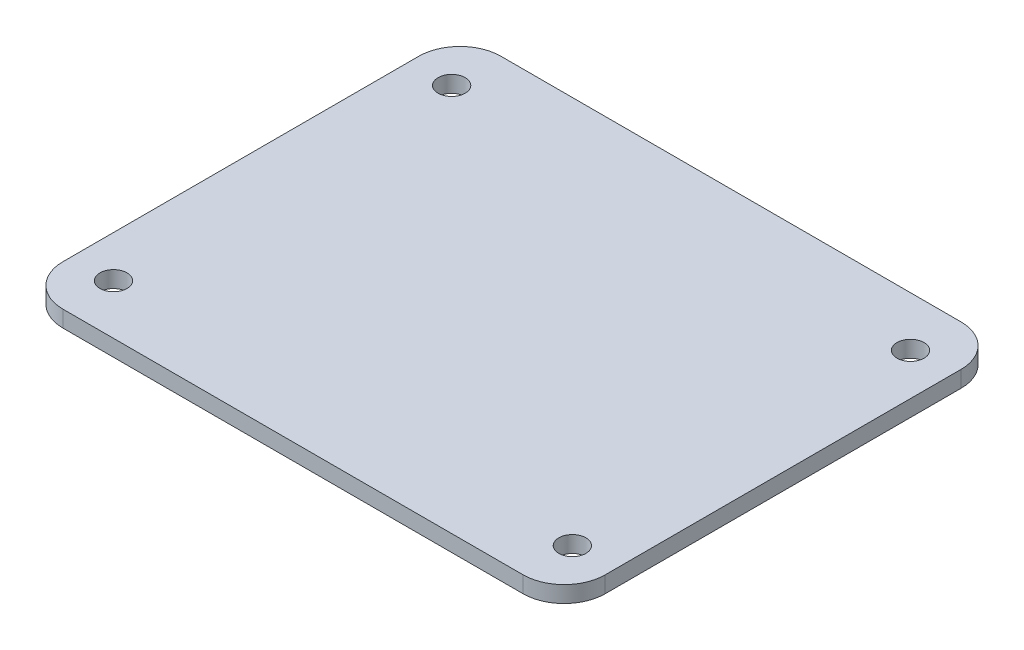
ISO-10303-21;
HEADER;
FILE_DESCRIPTION(('STEP AP214'),'2;1');
FILE_NAME('part.step','',(''),(''),'','','');
FILE_SCHEMA(('AUTOMOTIVE_DESIGN { 1 0 10303 214 1 1 1 1 }'));
ENDSEC;
DATA;
#1=APPLICATION_CONTEXT('core data for automotive mechanical design processes');
#2=APPLICATION_PROTOCOL_DEFINITION('international standard','automotive_design',2000,#1);
#3=PRODUCT_CONTEXT('',#1,'mechanical');
#4=PRODUCT('Part','Part','',(#3));
#5=PRODUCT_RELATED_PRODUCT_CATEGORY('part','',(#4));
#6=PRODUCT_DEFINITION_FORMATION('','',#4);
#7=PRODUCT_DEFINITION_CONTEXT('part definition',#1,'design');
#8=PRODUCT_DEFINITION('design','',#6,#7);
#9=PRODUCT_DEFINITION_SHAPE('','',#8);
#10=(LENGTH_UNIT() NAMED_UNIT(*) SI_UNIT(.MILLI.,.METRE.));
#11=(NAMED_UNIT(*) PLANE_ANGLE_UNIT() SI_UNIT($,.RADIAN.));
#12=(NAMED_UNIT(*) SI_UNIT($,.STERADIAN.) SOLID_ANGLE_UNIT());
#13=UNCERTAINTY_MEASURE_WITH_UNIT(LENGTH_MEASURE(1.E-05),#10,'distance_accuracy_value','');
#14=(GEOMETRIC_REPRESENTATION_CONTEXT(3) GLOBAL_UNCERTAINTY_ASSIGNED_CONTEXT((#13)) GLOBAL_UNIT_ASSIGNED_CONTEXT((#10,
#11,#12)) REPRESENTATION_CONTEXT('',''));
#15=CARTESIAN_POINT('',(0.,0.,0.));
#16=DIRECTION('',(0.,0.,1.));
#17=DIRECTION('',(1.,0.,0.));
#18=AXIS2_PLACEMENT_3D('',#15,#16,#17);
#19=CARTESIAN_POINT('',(0.,2.,0.));
#20=DIRECTION('',(0.,1.,0.));
#21=DIRECTION('',(0.,0.,1.));
#22=AXIS2_PLACEMENT_3D('',#19,#20,#21);
#23=PLANE('',#22);
#24=CARTESIAN_POINT('',(27.94,2.,20.59));
#25=DIRECTION('',(0.,1.,0.));
#26=DIRECTION('',(0.,0.,1.));
#27=AXIS2_PLACEMENT_3D('',#24,#25,#26);
#28=CIRCLE('',#27,1.65);
#29=CARTESIAN_POINT('',(27.94,2.,22.24));
#30=VERTEX_POINT('',#29);
#31=EDGE_CURVE('E188',#30,#30,#28,.T.);
#32=ORIENTED_EDGE('',*,*,#31,.F.);
#33=EDGE_LOOP('',(#32));
#34=FACE_BOUND('',#33,.T.);
#35=CARTESIAN_POINT('',(-27.94,2.,-20.59));
#36=DIRECTION('',(0.,1.,0.));
#37=DIRECTION('',(0.,0.,1.));
#38=AXIS2_PLACEMENT_3D('',#35,#36,#37);
#39=CIRCLE('',#38,1.65);
#40=CARTESIAN_POINT('',(-27.94,2.,-18.94));
#41=VERTEX_POINT('',#40);
#42=EDGE_CURVE('E178',#41,#41,#39,.T.);
#43=ORIENTED_EDGE('',*,*,#42,.F.);
#44=EDGE_LOOP('',(#43));
#45=FACE_BOUND('',#44,.T.);
#46=DIRECTION('',(-1.,0.,0.));
#47=VECTOR('',#46,1.);
#48=CARTESIAN_POINT('',(-33.02,2.,-26.67));
#49=LINE('',#48,#47);
#50=CARTESIAN_POINT('',(28.02,2.,-26.67));
#51=VERTEX_POINT('',#50);
#52=CARTESIAN_POINT('',(-28.02,2.,-26.67));
#53=VERTEX_POINT('',#52);
#54=EDGE_CURVE('E169',#51,#53,#49,.T.);
#55=ORIENTED_EDGE('',*,*,#54,.T.);
#56=CARTESIAN_POINT('',(-28.02,2.,-21.67));
#57=DIRECTION('',(0.,1.,0.));
#58=DIRECTION('',(0.,0.,1.));
#59=AXIS2_PLACEMENT_3D('',#56,#57,#58);
#60=CIRCLE('',#59,5.);
#61=CARTESIAN_POINT('',(-33.02,2.,-21.67));
#62=VERTEX_POINT('',#61);
#63=EDGE_CURVE('E147',#53,#62,#60,.T.);
#64=ORIENTED_EDGE('',*,*,#63,.T.);
#65=DIRECTION('',(0.,0.,1.));
#66=VECTOR('',#65,1.);
#67=CARTESIAN_POINT('',(-33.02,2.,-26.67));
#68=LINE('',#67,#66);
#69=CARTESIAN_POINT('',(-33.02,2.,21.67));
#70=VERTEX_POINT('',#69);
#71=EDGE_CURVE('E117',#62,#70,#68,.T.);
#72=ORIENTED_EDGE('',*,*,#71,.T.);
#73=CARTESIAN_POINT('',(-28.02,2.,21.67));
#74=DIRECTION('',(0.,1.,0.));
#75=DIRECTION('',(0.,0.,1.));
#76=AXIS2_PLACEMENT_3D('',#73,#74,#75);
#77=CIRCLE('',#76,5.);
#78=CARTESIAN_POINT('',(-28.02,2.,26.67));
#79=VERTEX_POINT('',#78);
#80=EDGE_CURVE('E53',#70,#79,#77,.T.);
#81=ORIENTED_EDGE('',*,*,#80,.T.);
#82=DIRECTION('',(1.,0.,0.));
#83=VECTOR('',#82,1.);
#84=CARTESIAN_POINT('',(-33.02,2.,26.67));
#85=LINE('',#84,#83);
#86=CARTESIAN_POINT('',(28.02,2.,26.67));
#87=VERTEX_POINT('',#86);
#88=EDGE_CURVE('E133',#79,#87,#85,.T.);
#89=ORIENTED_EDGE('',*,*,#88,.T.);
#90=CARTESIAN_POINT('',(28.02,2.,21.67));
#91=DIRECTION('',(0.,1.,0.));
#92=DIRECTION('',(0.,0.,1.));
#93=AXIS2_PLACEMENT_3D('',#90,#91,#92);
#94=CIRCLE('',#93,5.);
#95=CARTESIAN_POINT('',(33.02,2.,21.67));
#96=VERTEX_POINT('',#95);
#97=EDGE_CURVE('E143',#87,#96,#94,.T.);
#98=ORIENTED_EDGE('',*,*,#97,.T.);
#99=DIRECTION('',(0.,0.,-1.));
#100=VECTOR('',#99,1.);
#101=CARTESIAN_POINT('',(33.02,2.,-26.67));
#102=LINE('',#101,#100);
#103=CARTESIAN_POINT('',(33.02,2.,-21.67));
#104=VERTEX_POINT('',#103);
#105=EDGE_CURVE('E127',#96,#104,#102,.T.);
#106=ORIENTED_EDGE('',*,*,#105,.T.);
#107=CARTESIAN_POINT('',(28.02,2.,-21.67));
#108=DIRECTION('',(0.,1.,0.));
#109=DIRECTION('',(0.,0.,1.));
#110=AXIS2_PLACEMENT_3D('',#107,#108,#109);
#111=CIRCLE('',#110,5.);
#112=EDGE_CURVE('E145',#104,#51,#111,.T.);
#113=ORIENTED_EDGE('',*,*,#112,.T.);
#114=EDGE_LOOP('',(#55,#64,#72,#81,#89,#98,#106,#113));
#115=FACE_BOUND('',#114,.T.);
#116=CARTESIAN_POINT('',(27.94,2.,-20.59));
#117=DIRECTION('',(0.,1.,0.));
#118=DIRECTION('',(0.,0.,1.));
#119=AXIS2_PLACEMENT_3D('',#116,#117,#118);
#120=CIRCLE('',#119,1.65);
#121=CARTESIAN_POINT('',(27.94,2.,-18.94));
#122=VERTEX_POINT('',#121);
#123=EDGE_CURVE('E183',#122,#122,#120,.T.);
#124=ORIENTED_EDGE('',*,*,#123,.F.);
#125=EDGE_LOOP('',(#124));
#126=FACE_BOUND('',#125,.T.);
#127=CARTESIAN_POINT('',(-27.94,2.,20.59));
#128=DIRECTION('',(0.,1.,0.));
#129=DIRECTION('',(0.,0.,1.));
#130=AXIS2_PLACEMENT_3D('',#127,#128,#129);
#131=CIRCLE('',#130,1.65);
#132=CARTESIAN_POINT('',(-27.94,2.,22.24));
#133=VERTEX_POINT('',#132);
#134=EDGE_CURVE('E194',#133,#133,#131,.T.);
#135=ORIENTED_EDGE('',*,*,#134,.F.);
#136=EDGE_LOOP('',(#135));
#137=FACE_BOUND('',#136,.T.);
#138=ADVANCED_FACE('F33',(#34,#45,#115,#126,#137),#23,.T.);
#139=CARTESIAN_POINT('',(0.,0.,0.));
#140=DIRECTION('',(0.,1.,0.));
#141=DIRECTION('',(0.,0.,1.));
#142=AXIS2_PLACEMENT_3D('',#139,#140,#141);
#143=PLANE('',#142);
#144=CARTESIAN_POINT('',(27.94,0.,20.59));
#145=DIRECTION('',(0.,1.,0.));
#146=DIRECTION('',(0.,0.,1.));
#147=AXIS2_PLACEMENT_3D('',#144,#145,#146);
#148=CIRCLE('',#147,1.65);
#149=CARTESIAN_POINT('',(27.94,0.,22.24));
#150=VERTEX_POINT('',#149);
#151=EDGE_CURVE('E191',#150,#150,#148,.T.);
#152=ORIENTED_EDGE('',*,*,#151,.T.);
#153=EDGE_LOOP('',(#152));
#154=FACE_BOUND('',#153,.T.);
#155=CARTESIAN_POINT('',(-27.94,0.,-20.59));
#156=DIRECTION('',(0.,1.,0.));
#157=DIRECTION('',(0.,0.,1.));
#158=AXIS2_PLACEMENT_3D('',#155,#156,#157);
#159=CIRCLE('',#158,1.65);
#160=CARTESIAN_POINT('',(-27.94,0.,-18.94));
#161=VERTEX_POINT('',#160);
#162=EDGE_CURVE('E174',#161,#161,#159,.T.);
#163=ORIENTED_EDGE('',*,*,#162,.T.);
#164=EDGE_LOOP('',(#163));
#165=FACE_BOUND('',#164,.T.);
#166=DIRECTION('',(0.,0.,1.));
#167=VECTOR('',#166,1.);
#168=CARTESIAN_POINT('',(-33.02,0.,-26.67));
#169=LINE('',#168,#167);
#170=CARTESIAN_POINT('',(-33.02,0.,-21.67));
#171=VERTEX_POINT('',#170);
#172=CARTESIAN_POINT('',(-33.02,0.,21.67));
#173=VERTEX_POINT('',#172);
#174=EDGE_CURVE('E115',#171,#173,#169,.T.);
#175=ORIENTED_EDGE('',*,*,#174,.F.);
#176=CARTESIAN_POINT('',(-28.02,0.,-21.67));
#177=DIRECTION('',(0.,1.,0.));
#178=DIRECTION('',(0.,0.,1.));
#179=AXIS2_PLACEMENT_3D('',#176,#177,#178);
#180=CIRCLE('',#179,5.);
#181=CARTESIAN_POINT('',(-28.02,0.,-26.67));
#182=VERTEX_POINT('',#181);
#183=EDGE_CURVE('E98',#171,#182,#180,.F.);
#184=ORIENTED_EDGE('',*,*,#183,.T.);
#185=DIRECTION('',(-1.,0.,0.));
#186=VECTOR('',#185,1.);
#187=CARTESIAN_POINT('',(-33.02,0.,-26.67));
#188=LINE('',#187,#186);
#189=CARTESIAN_POINT('',(28.02,0.,-26.67));
#190=VERTEX_POINT('',#189);
#191=EDGE_CURVE('E125',#190,#182,#188,.T.);
#192=ORIENTED_EDGE('',*,*,#191,.F.);
#193=CARTESIAN_POINT('',(28.02,0.,-21.67));
#194=DIRECTION('',(0.,1.,0.));
#195=DIRECTION('',(0.,0.,1.));
#196=AXIS2_PLACEMENT_3D('',#193,#194,#195);
#197=CIRCLE('',#196,5.);
#198=CARTESIAN_POINT('',(33.02,0.,-21.67));
#199=VERTEX_POINT('',#198);
#200=EDGE_CURVE('E109',#190,#199,#197,.F.);
#201=ORIENTED_EDGE('',*,*,#200,.T.);
#202=DIRECTION('',(0.,0.,-1.));
#203=VECTOR('',#202,1.);
#204=CARTESIAN_POINT('',(33.02,0.,-26.67));
#205=LINE('',#204,#203);
#206=CARTESIAN_POINT('',(33.02,0.,21.67));
#207=VERTEX_POINT('',#206);
#208=EDGE_CURVE('E129',#207,#199,#205,.T.);
#209=ORIENTED_EDGE('',*,*,#208,.F.);
#210=CARTESIAN_POINT('',(28.02,0.,21.67));
#211=DIRECTION('',(0.,1.,0.));
#212=DIRECTION('',(0.,0.,1.));
#213=AXIS2_PLACEMENT_3D('',#210,#211,#212);
#214=CIRCLE('',#213,5.);
#215=CARTESIAN_POINT('',(28.02,0.,26.67));
#216=VERTEX_POINT('',#215);
#217=EDGE_CURVE('E136',#207,#216,#214,.F.);
#218=ORIENTED_EDGE('',*,*,#217,.T.);
#219=DIRECTION('',(1.,0.,0.));
#220=VECTOR('',#219,1.);
#221=CARTESIAN_POINT('',(-33.02,0.,26.67));
#222=LINE('',#221,#220);
#223=CARTESIAN_POINT('',(-28.02,0.,26.67));
#224=VERTEX_POINT('',#223);
#225=EDGE_CURVE('E124',#224,#216,#222,.T.);
#226=ORIENTED_EDGE('',*,*,#225,.F.);
#227=CARTESIAN_POINT('',(-28.02,0.,21.67));
#228=DIRECTION('',(0.,1.,0.));
#229=DIRECTION('',(0.,0.,1.));
#230=AXIS2_PLACEMENT_3D('',#227,#228,#229);
#231=CIRCLE('',#230,5.);
#232=EDGE_CURVE('E118',#224,#173,#231,.F.);
#233=ORIENTED_EDGE('',*,*,#232,.T.);
#234=EDGE_LOOP('',(#175,#184,#192,#201,#209,#218,#226,#233));
#235=FACE_BOUND('',#234,.T.);
#236=CARTESIAN_POINT('',(27.94,0.,-20.59));
#237=DIRECTION('',(0.,1.,0.));
#238=DIRECTION('',(0.,0.,1.));
#239=AXIS2_PLACEMENT_3D('',#236,#237,#238);
#240=CIRCLE('',#239,1.65);
#241=CARTESIAN_POINT('',(27.94,0.,-18.94));
#242=VERTEX_POINT('',#241);
#243=EDGE_CURVE('E185',#242,#242,#240,.T.);
#244=ORIENTED_EDGE('',*,*,#243,.T.);
#245=EDGE_LOOP('',(#244));
#246=FACE_BOUND('',#245,.T.);
#247=CARTESIAN_POINT('',(-27.94,0.,20.59));
#248=DIRECTION('',(0.,1.,0.));
#249=DIRECTION('',(0.,0.,1.));
#250=AXIS2_PLACEMENT_3D('',#247,#248,#249);
#251=CIRCLE('',#250,1.65);
#252=CARTESIAN_POINT('',(-27.94,0.,22.24));
#253=VERTEX_POINT('',#252);
#254=EDGE_CURVE('E197',#253,#253,#251,.T.);
#255=ORIENTED_EDGE('',*,*,#254,.T.);
#256=EDGE_LOOP('',(#255));
#257=FACE_BOUND('',#256,.T.);
#258=ADVANCED_FACE('F121',(#154,#165,#235,#246,#257),#143,.F.);
#259=CARTESIAN_POINT('',(33.02,2.,-26.67));
#260=DIRECTION('',(-1.,0.,0.));
#261=DIRECTION('',(0.,0.,1.));
#262=AXIS2_PLACEMENT_3D('',#259,#260,#261);
#263=PLANE('',#262);
#264=ORIENTED_EDGE('',*,*,#208,.T.);
#265=DIRECTION('',(0.,-1.,0.));
#266=VECTOR('',#265,1.);
#267=CARTESIAN_POINT('',(33.02,2.,-21.67));
#268=LINE('',#267,#266);
#269=EDGE_CURVE('E152',#199,#104,#268,.F.);
#270=ORIENTED_EDGE('',*,*,#269,.T.);
#271=ORIENTED_EDGE('',*,*,#105,.F.);
#272=DIRECTION('',(0.,-1.,0.));
#273=VECTOR('',#272,1.);
#274=CARTESIAN_POINT('',(33.02,2.,21.67));
#275=LINE('',#274,#273);
#276=EDGE_CURVE('E149',#96,#207,#275,.T.);
#277=ORIENTED_EDGE('',*,*,#276,.T.);
#278=EDGE_LOOP('',(#264,#270,#271,#277));
#279=FACE_BOUND('',#278,.T.);
#280=ADVANCED_FACE('F165',(#279),#263,.F.);
#281=CARTESIAN_POINT('',(-33.02,2.,-26.67));
#282=DIRECTION('',(0.,0.,1.));
#283=DIRECTION('',(1.,0.,0.));
#284=AXIS2_PLACEMENT_3D('',#281,#282,#283);
#285=PLANE('',#284);
#286=ORIENTED_EDGE('',*,*,#191,.T.);
#287=DIRECTION('',(0.,-1.,0.));
#288=VECTOR('',#287,1.);
#289=CARTESIAN_POINT('',(-28.02,2.,-26.67));
#290=LINE('',#289,#288);
#291=EDGE_CURVE('E103',#182,#53,#290,.F.);
#292=ORIENTED_EDGE('',*,*,#291,.T.);
#293=ORIENTED_EDGE('',*,*,#54,.F.);
#294=DIRECTION('',(0.,-1.,0.));
#295=VECTOR('',#294,1.);
#296=CARTESIAN_POINT('',(28.02,2.,-26.67));
#297=LINE('',#296,#295);
#298=EDGE_CURVE('E108',#51,#190,#297,.T.);
#299=ORIENTED_EDGE('',*,*,#298,.T.);
#300=EDGE_LOOP('',(#286,#292,#293,#299));
#301=FACE_BOUND('',#300,.T.);
#302=ADVANCED_FACE('F224',(#301),#285,.F.);
#303=CARTESIAN_POINT('',(-33.02,2.,-26.67));
#304=DIRECTION('',(1.,0.,0.));
#305=DIRECTION('',(0.,0.,-1.));
#306=AXIS2_PLACEMENT_3D('',#303,#304,#305);
#307=PLANE('',#306);
#308=ORIENTED_EDGE('',*,*,#71,.F.);
#309=DIRECTION('',(0.,-1.,0.));
#310=VECTOR('',#309,1.);
#311=CARTESIAN_POINT('',(-33.02,2.,-21.67));
#312=LINE('',#311,#310);
#313=EDGE_CURVE('E102',#62,#171,#312,.T.);
#314=ORIENTED_EDGE('',*,*,#313,.T.);
#315=ORIENTED_EDGE('',*,*,#174,.T.);
#316=DIRECTION('',(0.,-1.,0.));
#317=VECTOR('',#316,1.);
#318=CARTESIAN_POINT('',(-33.02,2.,21.67));
#319=LINE('',#318,#317);
#320=EDGE_CURVE('E119',#173,#70,#319,.F.);
#321=ORIENTED_EDGE('',*,*,#320,.T.);
#322=EDGE_LOOP('',(#308,#314,#315,#321));
#323=FACE_BOUND('',#322,.T.);
#324=ADVANCED_FACE('F114',(#323),#307,.F.);
#325=CARTESIAN_POINT('',(-33.02,2.,26.67));
#326=DIRECTION('',(0.,0.,-1.));
#327=DIRECTION('',(-1.,0.,0.));
#328=AXIS2_PLACEMENT_3D('',#325,#326,#327);
#329=PLANE('',#328);
#330=ORIENTED_EDGE('',*,*,#225,.T.);
#331=DIRECTION('',(0.,-1.,0.));
#332=VECTOR('',#331,1.);
#333=CARTESIAN_POINT('',(28.02,2.,26.67));
#334=LINE('',#333,#332);
#335=EDGE_CURVE('E11',#216,#87,#334,.F.);
#336=ORIENTED_EDGE('',*,*,#335,.T.);
#337=ORIENTED_EDGE('',*,*,#88,.F.);
#338=DIRECTION('',(0.,-1.,0.));
#339=VECTOR('',#338,1.);
#340=CARTESIAN_POINT('',(-28.02,2.,26.67));
#341=LINE('',#340,#339);
#342=EDGE_CURVE('E41',#79,#224,#341,.T.);
#343=ORIENTED_EDGE('',*,*,#342,.T.);
#344=EDGE_LOOP('',(#330,#336,#337,#343));
#345=FACE_BOUND('',#344,.T.);
#346=ADVANCED_FACE('F155',(#345),#329,.F.);
#347=CARTESIAN_POINT('',(-27.94,2.,-20.59));
#348=DIRECTION('',(0.,-1.,0.));
#349=DIRECTION('',(0.,0.,-1.));
#350=AXIS2_PLACEMENT_3D('',#347,#348,#349);
#351=CYLINDRICAL_SURFACE('',#350,1.65);
#352=ORIENTED_EDGE('',*,*,#42,.T.);
#353=EDGE_LOOP('',(#352));
#354=FACE_BOUND('',#353,.T.);
#355=ORIENTED_EDGE('',*,*,#162,.F.);
#356=EDGE_LOOP('',(#355));
#357=FACE_BOUND('',#356,.T.);
#358=ADVANCED_FACE('F217',(#354,#357),#351,.F.);
#359=CARTESIAN_POINT('',(27.94,2.,-20.59));
#360=DIRECTION('',(0.,-1.,0.));
#361=DIRECTION('',(0.,0.,-1.));
#362=AXIS2_PLACEMENT_3D('',#359,#360,#361);
#363=CYLINDRICAL_SURFACE('',#362,1.65);
#364=ORIENTED_EDGE('',*,*,#123,.T.);
#365=EDGE_LOOP('',(#364));
#366=FACE_BOUND('',#365,.T.);
#367=ORIENTED_EDGE('',*,*,#243,.F.);
#368=EDGE_LOOP('',(#367));
#369=FACE_BOUND('',#368,.T.);
#370=ADVANCED_FACE('F246',(#366,#369),#363,.F.);
#371=CARTESIAN_POINT('',(27.94,2.,20.59));
#372=DIRECTION('',(0.,-1.,0.));
#373=DIRECTION('',(0.,0.,-1.));
#374=AXIS2_PLACEMENT_3D('',#371,#372,#373);
#375=CYLINDRICAL_SURFACE('',#374,1.65);
#376=ORIENTED_EDGE('',*,*,#31,.T.);
#377=EDGE_LOOP('',(#376));
#378=FACE_BOUND('',#377,.T.);
#379=ORIENTED_EDGE('',*,*,#151,.F.);
#380=EDGE_LOOP('',(#379));
#381=FACE_BOUND('',#380,.T.);
#382=ADVANCED_FACE('F249',(#378,#381),#375,.F.);
#383=CARTESIAN_POINT('',(-27.94,2.,20.59));
#384=DIRECTION('',(0.,-1.,0.));
#385=DIRECTION('',(0.,0.,-1.));
#386=AXIS2_PLACEMENT_3D('',#383,#384,#385);
#387=CYLINDRICAL_SURFACE('',#386,1.65);
#388=ORIENTED_EDGE('',*,*,#134,.T.);
#389=EDGE_LOOP('',(#388));
#390=FACE_BOUND('',#389,.T.);
#391=ORIENTED_EDGE('',*,*,#254,.F.);
#392=EDGE_LOOP('',(#391));
#393=FACE_BOUND('',#392,.T.);
#394=ADVANCED_FACE('F203',(#390,#393),#387,.F.);
#395=CARTESIAN_POINT('',(-28.02,2.,-21.67));
#396=DIRECTION('',(0.,-1.,0.));
#397=DIRECTION('',(0.,0.,-1.));
#398=AXIS2_PLACEMENT_3D('',#395,#396,#397);
#399=CYLINDRICAL_SURFACE('',#398,5.);
#400=ORIENTED_EDGE('',*,*,#63,.F.);
#401=ORIENTED_EDGE('',*,*,#291,.F.);
#402=ORIENTED_EDGE('',*,*,#183,.F.);
#403=ORIENTED_EDGE('',*,*,#313,.F.);
#404=EDGE_LOOP('',(#400,#401,#402,#403));
#405=FACE_BOUND('',#404,.T.);
#406=ADVANCED_FACE('F101',(#405),#399,.T.);
#407=CARTESIAN_POINT('',(28.02,2.,-21.67));
#408=DIRECTION('',(0.,-1.,0.));
#409=DIRECTION('',(0.,0.,-1.));
#410=AXIS2_PLACEMENT_3D('',#407,#408,#409);
#411=CYLINDRICAL_SURFACE('',#410,5.);
#412=ORIENTED_EDGE('',*,*,#112,.F.);
#413=ORIENTED_EDGE('',*,*,#269,.F.);
#414=ORIENTED_EDGE('',*,*,#200,.F.);
#415=ORIENTED_EDGE('',*,*,#298,.F.);
#416=EDGE_LOOP('',(#412,#413,#414,#415));
#417=FACE_BOUND('',#416,.T.);
#418=ADVANCED_FACE('F232',(#417),#411,.T.);
#419=CARTESIAN_POINT('',(28.02,2.,21.67));
#420=DIRECTION('',(0.,-1.,0.));
#421=DIRECTION('',(0.,0.,-1.));
#422=AXIS2_PLACEMENT_3D('',#419,#420,#421);
#423=CYLINDRICAL_SURFACE('',#422,5.);
#424=ORIENTED_EDGE('',*,*,#97,.F.);
#425=ORIENTED_EDGE('',*,*,#335,.F.);
#426=ORIENTED_EDGE('',*,*,#217,.F.);
#427=ORIENTED_EDGE('',*,*,#276,.F.);
#428=EDGE_LOOP('',(#424,#425,#426,#427));
#429=FACE_BOUND('',#428,.T.);
#430=ADVANCED_FACE('F162',(#429),#423,.T.);
#431=CARTESIAN_POINT('',(-28.02,2.,21.67));
#432=DIRECTION('',(0.,-1.,0.));
#433=DIRECTION('',(0.,0.,-1.));
#434=AXIS2_PLACEMENT_3D('',#431,#432,#433);
#435=CYLINDRICAL_SURFACE('',#434,5.);
#436=ORIENTED_EDGE('',*,*,#80,.F.);
#437=ORIENTED_EDGE('',*,*,#320,.F.);
#438=ORIENTED_EDGE('',*,*,#232,.F.);
#439=ORIENTED_EDGE('',*,*,#342,.F.);
#440=EDGE_LOOP('',(#436,#437,#438,#439));
#441=FACE_BOUND('',#440,.T.);
#442=ADVANCED_FACE('F35',(#441),#435,.T.);
#443=CLOSED_SHELL('',(#138,#258,#280,#302,#324,#346,#358,#370,#382,#394,#406,#418,#430,#442));
#444=MANIFOLD_SOLID_BREP('B2',#443);
#445=ADVANCED_BREP_SHAPE_REPRESENTATION('',(#18,#444),#14);
#446=SHAPE_DEFINITION_REPRESENTATION(#9,#445);
ENDSEC;
END-ISO-10303-21;
